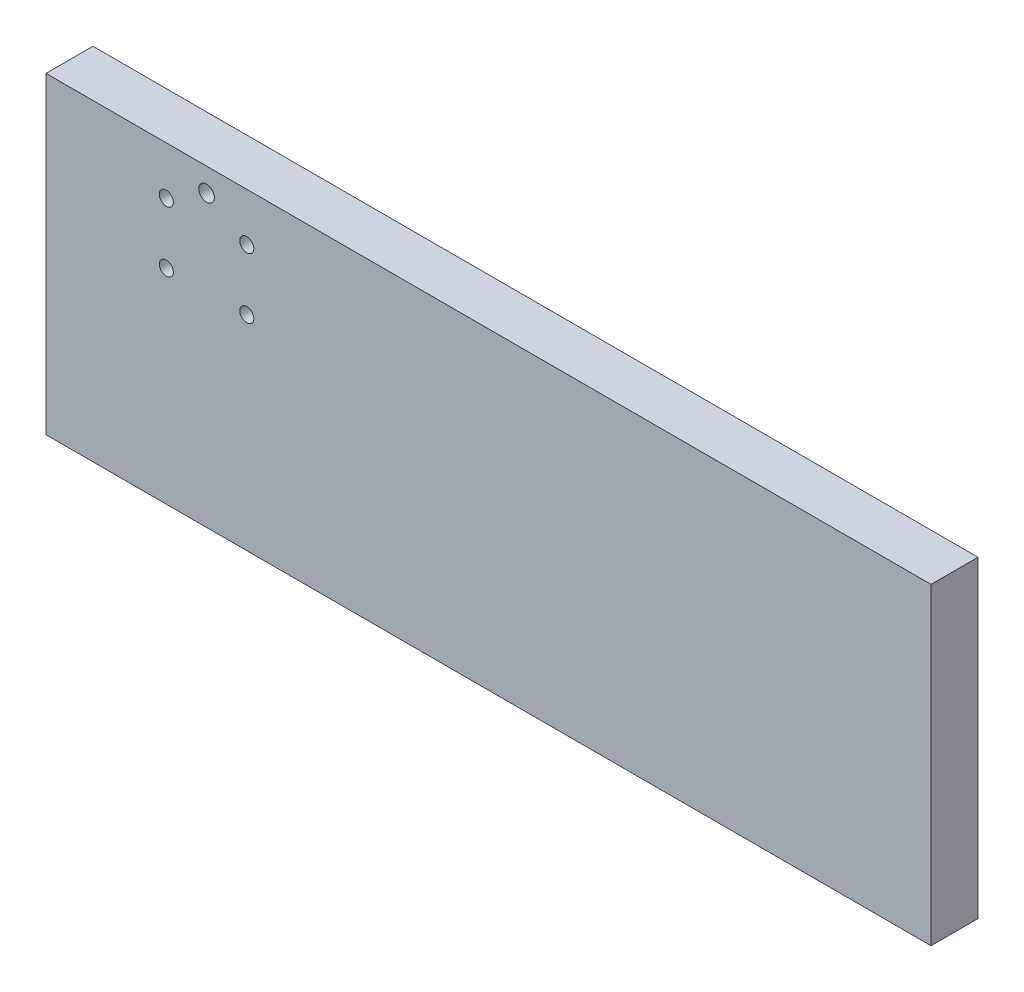
ISO-10303-21;
HEADER;
FILE_DESCRIPTION(('STEP AP214'),'2;1');
FILE_NAME('part.step','',(''),(''),'','','');
FILE_SCHEMA(('AUTOMOTIVE_DESIGN { 1 0 10303 214 1 1 1 1 }'));
ENDSEC;
DATA;
#1=APPLICATION_CONTEXT('core data for automotive mechanical design processes');
#2=APPLICATION_PROTOCOL_DEFINITION('international standard','automotive_design',2000,#1);
#3=PRODUCT_CONTEXT('',#1,'mechanical');
#4=PRODUCT('Part','Part','',(#3));
#5=PRODUCT_RELATED_PRODUCT_CATEGORY('part','',(#4));
#6=PRODUCT_DEFINITION_FORMATION('','',#4);
#7=PRODUCT_DEFINITION_CONTEXT('part definition',#1,'design');
#8=PRODUCT_DEFINITION('design','',#6,#7);
#9=PRODUCT_DEFINITION_SHAPE('','',#8);
#10=(LENGTH_UNIT() NAMED_UNIT(*) SI_UNIT(.MILLI.,.METRE.));
#11=(NAMED_UNIT(*) PLANE_ANGLE_UNIT() SI_UNIT($,.RADIAN.));
#12=(NAMED_UNIT(*) SI_UNIT($,.STERADIAN.) SOLID_ANGLE_UNIT());
#13=UNCERTAINTY_MEASURE_WITH_UNIT(LENGTH_MEASURE(1.E-05),#10,'distance_accuracy_value','');
#14=(GEOMETRIC_REPRESENTATION_CONTEXT(3) GLOBAL_UNCERTAINTY_ASSIGNED_CONTEXT((#13)) GLOBAL_UNIT_ASSIGNED_CONTEXT((#10,
#11,#12)) REPRESENTATION_CONTEXT('',''));
#15=CARTESIAN_POINT('',(0.,0.,0.));
#16=DIRECTION('',(0.,0.,1.));
#17=DIRECTION('',(1.,0.,0.));
#18=AXIS2_PLACEMENT_3D('',#15,#16,#17);
#19=CARTESIAN_POINT('',(0.,0.,19.05));
#20=DIRECTION('',(1.,0.,0.));
#21=DIRECTION('',(0.,0.,-1.));
#22=AXIS2_PLACEMENT_3D('',#19,#20,#21);
#23=PLANE('',#22);
#24=DIRECTION('',(0.,-1.,0.));
#25=VECTOR('',#24,1.);
#26=CARTESIAN_POINT('',(0.,0.,0.));
#27=LINE('',#26,#25);
#28=CARTESIAN_POINT('',(0.,127.,0.));
#29=VERTEX_POINT('',#28);
#30=CARTESIAN_POINT('',(0.,0.,0.));
#31=VERTEX_POINT('',#30);
#32=EDGE_CURVE('E96',#29,#31,#27,.T.);
#33=ORIENTED_EDGE('',*,*,#32,.T.);
#34=DIRECTION('',(0.,0.,-1.));
#35=VECTOR('',#34,1.);
#36=CARTESIAN_POINT('',(0.,0.,19.05));
#37=LINE('',#36,#35);
#38=CARTESIAN_POINT('',(0.,0.,19.05));
#39=VERTEX_POINT('',#38);
#40=EDGE_CURVE('E11',#39,#31,#37,.T.);
#41=ORIENTED_EDGE('',*,*,#40,.F.);
#42=DIRECTION('',(0.,-1.,0.));
#43=VECTOR('',#42,1.);
#44=CARTESIAN_POINT('',(0.,0.,19.05));
#45=LINE('',#44,#43);
#46=CARTESIAN_POINT('',(0.,127.,19.05));
#47=VERTEX_POINT('',#46);
#48=EDGE_CURVE('E84',#47,#39,#45,.T.);
#49=ORIENTED_EDGE('',*,*,#48,.F.);
#50=DIRECTION('',(0.,0.,-1.));
#51=VECTOR('',#50,1.);
#52=CARTESIAN_POINT('',(0.,127.,19.05));
#53=LINE('',#52,#51);
#54=EDGE_CURVE('E92',#47,#29,#53,.T.);
#55=ORIENTED_EDGE('',*,*,#54,.T.);
#56=EDGE_LOOP('',(#33,#41,#49,#55));
#57=FACE_BOUND('',#56,.T.);
#58=ADVANCED_FACE('F33',(#57),#23,.F.);
#59=CARTESIAN_POINT('',(0.,0.,19.05));
#60=DIRECTION('',(0.,1.,0.));
#61=DIRECTION('',(0.,0.,1.));
#62=AXIS2_PLACEMENT_3D('',#59,#60,#61);
#63=PLANE('',#62);
#64=DIRECTION('',(1.,0.,0.));
#65=VECTOR('',#64,1.);
#66=CARTESIAN_POINT('',(0.,0.,0.));
#67=LINE('',#66,#65);
#68=CARTESIAN_POINT('',(359.156,0.,0.));
#69=VERTEX_POINT('',#68);
#70=EDGE_CURVE('E88',#31,#69,#67,.T.);
#71=ORIENTED_EDGE('',*,*,#70,.T.);
#72=DIRECTION('',(0.,0.,-1.));
#73=VECTOR('',#72,1.);
#74=CARTESIAN_POINT('',(359.156,0.,19.05));
#75=LINE('',#74,#73);
#76=CARTESIAN_POINT('',(359.156,0.,19.05));
#77=VERTEX_POINT('',#76);
#78=EDGE_CURVE('E41',#77,#69,#75,.T.);
#79=ORIENTED_EDGE('',*,*,#78,.F.);
#80=DIRECTION('',(1.,0.,0.));
#81=VECTOR('',#80,1.);
#82=CARTESIAN_POINT('',(0.,0.,19.05));
#83=LINE('',#82,#81);
#84=EDGE_CURVE('E79',#39,#77,#83,.T.);
#85=ORIENTED_EDGE('',*,*,#84,.F.);
#86=ORIENTED_EDGE('',*,*,#40,.T.);
#87=EDGE_LOOP('',(#71,#79,#85,#86));
#88=FACE_BOUND('',#87,.T.);
#89=ADVANCED_FACE('F87',(#88),#63,.F.);
#90=CARTESIAN_POINT('',(359.156,0.,19.05));
#91=DIRECTION('',(-1.,0.,0.));
#92=DIRECTION('',(0.,0.,1.));
#93=AXIS2_PLACEMENT_3D('',#90,#91,#92);
#94=PLANE('',#93);
#95=DIRECTION('',(0.,1.,0.));
#96=VECTOR('',#95,1.);
#97=CARTESIAN_POINT('',(359.156,0.,0.));
#98=LINE('',#97,#96);
#99=CARTESIAN_POINT('',(359.156,127.,0.));
#100=VERTEX_POINT('',#99);
#101=EDGE_CURVE('E66',#69,#100,#98,.T.);
#102=ORIENTED_EDGE('',*,*,#101,.T.);
#103=DIRECTION('',(0.,0.,-1.));
#104=VECTOR('',#103,1.);
#105=CARTESIAN_POINT('',(359.156,127.,19.05));
#106=LINE('',#105,#104);
#107=CARTESIAN_POINT('',(359.156,127.,19.05));
#108=VERTEX_POINT('',#107);
#109=EDGE_CURVE('E89',#108,#100,#106,.T.);
#110=ORIENTED_EDGE('',*,*,#109,.F.);
#111=DIRECTION('',(0.,1.,0.));
#112=VECTOR('',#111,1.);
#113=CARTESIAN_POINT('',(359.156,0.,19.05));
#114=LINE('',#113,#112);
#115=EDGE_CURVE('E82',#77,#108,#114,.T.);
#116=ORIENTED_EDGE('',*,*,#115,.F.);
#117=ORIENTED_EDGE('',*,*,#78,.T.);
#118=EDGE_LOOP('',(#102,#110,#116,#117));
#119=FACE_BOUND('',#118,.T.);
#120=ADVANCED_FACE('F90',(#119),#94,.F.);
#121=CARTESIAN_POINT('',(0.,127.,19.05));
#122=DIRECTION('',(0.,-1.,0.));
#123=DIRECTION('',(0.,0.,-1.));
#124=AXIS2_PLACEMENT_3D('',#121,#122,#123);
#125=PLANE('',#124);
#126=DIRECTION('',(-1.,0.,0.));
#127=VECTOR('',#126,1.);
#128=CARTESIAN_POINT('',(0.,127.,0.));
#129=LINE('',#128,#127);
#130=EDGE_CURVE('E72',#100,#29,#129,.T.);
#131=ORIENTED_EDGE('',*,*,#130,.T.);
#132=ORIENTED_EDGE('',*,*,#54,.F.);
#133=DIRECTION('',(-1.,0.,0.));
#134=VECTOR('',#133,1.);
#135=CARTESIAN_POINT('',(0.,127.,19.05));
#136=LINE('',#135,#134);
#137=EDGE_CURVE('E49',#108,#47,#136,.T.);
#138=ORIENTED_EDGE('',*,*,#137,.F.);
#139=ORIENTED_EDGE('',*,*,#109,.T.);
#140=EDGE_LOOP('',(#131,#132,#138,#139));
#141=FACE_BOUND('',#140,.T.);
#142=ADVANCED_FACE('F104',(#141),#125,.F.);
#143=CARTESIAN_POINT('',(0.,0.,19.05));
#144=DIRECTION('',(0.,0.,-1.));
#145=DIRECTION('',(-1.,0.,0.));
#146=AXIS2_PLACEMENT_3D('',#143,#144,#145);
#147=PLANE('',#146);
#148=CARTESIAN_POINT('',(65.1510000000813,117.475000000113,19.05));
#149=DIRECTION('',(0.,0.,-1.));
#150=DIRECTION('',(-1.,0.,0.));
#151=AXIS2_PLACEMENT_3D('',#148,#149,#150);
#152=CIRCLE('',#151,3.175);
#153=CARTESIAN_POINT('',(61.9760000000813,117.475000000113,19.05));
#154=VERTEX_POINT('',#153);
#155=EDGE_CURVE('E120',#154,#154,#152,.F.);
#156=ORIENTED_EDGE('',*,*,#155,.F.);
#157=EDGE_LOOP('',(#156));
#158=FACE_BOUND('',#157,.T.);
#159=CARTESIAN_POINT('',(81.47685,82.9627499999999,19.05));
#160=DIRECTION('',(0.,0.,1.));
#161=DIRECTION('',(1.,0.,0.));
#162=AXIS2_PLACEMENT_3D('',#159,#160,#161);
#163=CIRCLE('',#162,2.85115);
#164=CARTESIAN_POINT('',(84.328,82.9627499999999,19.05));
#165=VERTEX_POINT('',#164);
#166=EDGE_CURVE('E119',#165,#165,#163,.T.);
#167=ORIENTED_EDGE('',*,*,#166,.F.);
#168=EDGE_LOOP('',(#167));
#169=FACE_BOUND('',#168,.T.);
#170=CARTESIAN_POINT('',(81.47685,107.53725,19.05));
#171=DIRECTION('',(0.,0.,1.));
#172=DIRECTION('',(1.,0.,0.));
#173=AXIS2_PLACEMENT_3D('',#170,#171,#172);
#174=CIRCLE('',#173,2.85115);
#175=CARTESIAN_POINT('',(84.328,107.53725,19.05));
#176=VERTEX_POINT('',#175);
#177=EDGE_CURVE('E126',#176,#176,#174,.T.);
#178=ORIENTED_EDGE('',*,*,#177,.F.);
#179=EDGE_LOOP('',(#178));
#180=FACE_BOUND('',#179,.T.);
#181=CARTESIAN_POINT('',(48.82515,107.53725,19.05));
#182=DIRECTION('',(0.,0.,1.));
#183=DIRECTION('',(1.,0.,0.));
#184=AXIS2_PLACEMENT_3D('',#181,#182,#183);
#185=CIRCLE('',#184,2.85115);
#186=CARTESIAN_POINT('',(51.6763,107.53725,19.05));
#187=VERTEX_POINT('',#186);
#188=EDGE_CURVE('E113',#187,#187,#185,.T.);
#189=ORIENTED_EDGE('',*,*,#188,.F.);
#190=EDGE_LOOP('',(#189));
#191=FACE_BOUND('',#190,.T.);
#192=CARTESIAN_POINT('',(48.82515,82.96275,19.05));
#193=DIRECTION('',(0.,0.,1.));
#194=DIRECTION('',(1.,0.,0.));
#195=AXIS2_PLACEMENT_3D('',#192,#193,#194);
#196=CIRCLE('',#195,2.85115);
#197=CARTESIAN_POINT('',(51.6763,82.96275,19.05));
#198=VERTEX_POINT('',#197);
#199=EDGE_CURVE('E99',#198,#198,#196,.T.);
#200=ORIENTED_EDGE('',*,*,#199,.F.);
#201=EDGE_LOOP('',(#200));
#202=FACE_BOUND('',#201,.T.);
#203=ORIENTED_EDGE('',*,*,#48,.T.);
#204=ORIENTED_EDGE('',*,*,#84,.T.);
#205=ORIENTED_EDGE('',*,*,#115,.T.);
#206=ORIENTED_EDGE('',*,*,#137,.T.);
#207=EDGE_LOOP('',(#203,#204,#205,#206));
#208=FACE_BOUND('',#207,.T.);
#209=ADVANCED_FACE('F80',(#158,#169,#180,#191,#202,#208),#147,.F.);
#210=CARTESIAN_POINT('',(0.,0.,0.));
#211=DIRECTION('',(0.,0.,-1.));
#212=DIRECTION('',(-1.,0.,0.));
#213=AXIS2_PLACEMENT_3D('',#210,#211,#212);
#214=PLANE('',#213);
#215=CARTESIAN_POINT('',(65.1510000000813,117.475000000113,0.));
#216=DIRECTION('',(0.,0.,-1.));
#217=DIRECTION('',(-1.,0.,0.));
#218=AXIS2_PLACEMENT_3D('',#215,#216,#217);
#219=CIRCLE('',#218,3.175);
#220=CARTESIAN_POINT('',(61.9760000000813,117.475000000113,0.));
#221=VERTEX_POINT('',#220);
#222=EDGE_CURVE('E136',#221,#221,#219,.T.);
#223=ORIENTED_EDGE('',*,*,#222,.F.);
#224=EDGE_LOOP('',(#223));
#225=FACE_BOUND('',#224,.T.);
#226=CARTESIAN_POINT('',(81.47685,82.9627499999999,0.));
#227=DIRECTION('',(0.,0.,-1.));
#228=DIRECTION('',(-1.,0.,0.));
#229=AXIS2_PLACEMENT_3D('',#226,#227,#228);
#230=CIRCLE('',#229,2.85115);
#231=CARTESIAN_POINT('',(78.6257,82.9627499999999,0.));
#232=VERTEX_POINT('',#231);
#233=EDGE_CURVE('E116',#232,#232,#230,.F.);
#234=ORIENTED_EDGE('',*,*,#233,.T.);
#235=EDGE_LOOP('',(#234));
#236=FACE_BOUND('',#235,.T.);
#237=CARTESIAN_POINT('',(81.47685,107.53725,0.));
#238=DIRECTION('',(0.,0.,-1.));
#239=DIRECTION('',(-1.,0.,0.));
#240=AXIS2_PLACEMENT_3D('',#237,#238,#239);
#241=CIRCLE('',#240,2.85115);
#242=CARTESIAN_POINT('',(78.6257,107.53725,0.));
#243=VERTEX_POINT('',#242);
#244=EDGE_CURVE('E123',#243,#243,#241,.F.);
#245=ORIENTED_EDGE('',*,*,#244,.T.);
#246=EDGE_LOOP('',(#245));
#247=FACE_BOUND('',#246,.T.);
#248=CARTESIAN_POINT('',(48.82515,107.53725,0.));
#249=DIRECTION('',(0.,0.,-1.));
#250=DIRECTION('',(-1.,0.,0.));
#251=AXIS2_PLACEMENT_3D('',#248,#249,#250);
#252=CIRCLE('',#251,2.85115);
#253=CARTESIAN_POINT('',(45.974,107.53725,0.));
#254=VERTEX_POINT('',#253);
#255=EDGE_CURVE('E129',#254,#254,#252,.F.);
#256=ORIENTED_EDGE('',*,*,#255,.T.);
#257=EDGE_LOOP('',(#256));
#258=FACE_BOUND('',#257,.T.);
#259=CARTESIAN_POINT('',(48.82515,82.96275,0.));
#260=DIRECTION('',(0.,0.,-1.));
#261=DIRECTION('',(-1.,0.,0.));
#262=AXIS2_PLACEMENT_3D('',#259,#260,#261);
#263=CIRCLE('',#262,2.85115);
#264=CARTESIAN_POINT('',(45.974,82.96275,0.));
#265=VERTEX_POINT('',#264);
#266=EDGE_CURVE('E110',#265,#265,#263,.F.);
#267=ORIENTED_EDGE('',*,*,#266,.T.);
#268=EDGE_LOOP('',(#267));
#269=FACE_BOUND('',#268,.T.);
#270=ORIENTED_EDGE('',*,*,#32,.F.);
#271=ORIENTED_EDGE('',*,*,#130,.F.);
#272=ORIENTED_EDGE('',*,*,#101,.F.);
#273=ORIENTED_EDGE('',*,*,#70,.F.);
#274=EDGE_LOOP('',(#270,#271,#272,#273));
#275=FACE_BOUND('',#274,.T.);
#276=ADVANCED_FACE('F107',(#225,#236,#247,#258,#269,#275),#214,.T.);
#277=CARTESIAN_POINT('',(48.82515,82.96275,-0.001000000000001));
#278=DIRECTION('',(0.,0.,1.));
#279=DIRECTION('',(1.,0.,0.));
#280=AXIS2_PLACEMENT_3D('',#277,#278,#279);
#281=CYLINDRICAL_SURFACE('',#280,2.85115);
#282=ORIENTED_EDGE('',*,*,#266,.F.);
#283=EDGE_LOOP('',(#282));
#284=FACE_BOUND('',#283,.T.);
#285=ORIENTED_EDGE('',*,*,#199,.T.);
#286=EDGE_LOOP('',(#285));
#287=FACE_BOUND('',#286,.T.);
#288=ADVANCED_FACE('F145',(#284,#287),#281,.F.);
#289=CARTESIAN_POINT('',(48.82515,107.53725,-0.001000000000001));
#290=DIRECTION('',(0.,0.,1.));
#291=DIRECTION('',(1.,0.,0.));
#292=AXIS2_PLACEMENT_3D('',#289,#290,#291);
#293=CYLINDRICAL_SURFACE('',#292,2.85115);
#294=ORIENTED_EDGE('',*,*,#255,.F.);
#295=EDGE_LOOP('',(#294));
#296=FACE_BOUND('',#295,.T.);
#297=ORIENTED_EDGE('',*,*,#188,.T.);
#298=EDGE_LOOP('',(#297));
#299=FACE_BOUND('',#298,.T.);
#300=ADVANCED_FACE('F157',(#296,#299),#293,.F.);
#301=CARTESIAN_POINT('',(81.47685,107.53725,-0.001000000000001));
#302=DIRECTION('',(0.,0.,1.));
#303=DIRECTION('',(1.,0.,0.));
#304=AXIS2_PLACEMENT_3D('',#301,#302,#303);
#305=CYLINDRICAL_SURFACE('',#304,2.85115);
#306=ORIENTED_EDGE('',*,*,#244,.F.);
#307=EDGE_LOOP('',(#306));
#308=FACE_BOUND('',#307,.T.);
#309=ORIENTED_EDGE('',*,*,#177,.T.);
#310=EDGE_LOOP('',(#309));
#311=FACE_BOUND('',#310,.T.);
#312=ADVANCED_FACE('F201',(#308,#311),#305,.F.);
#313=CARTESIAN_POINT('',(81.47685,82.9627499999999,-0.001000000000001));
#314=DIRECTION('',(0.,0.,1.));
#315=DIRECTION('',(1.,0.,0.));
#316=AXIS2_PLACEMENT_3D('',#313,#314,#315);
#317=CYLINDRICAL_SURFACE('',#316,2.85115);
#318=ORIENTED_EDGE('',*,*,#233,.F.);
#319=EDGE_LOOP('',(#318));
#320=FACE_BOUND('',#319,.T.);
#321=ORIENTED_EDGE('',*,*,#166,.T.);
#322=EDGE_LOOP('',(#321));
#323=FACE_BOUND('',#322,.T.);
#324=ADVANCED_FACE('F211',(#320,#323),#317,.F.);
#325=CARTESIAN_POINT('',(65.1510000000813,117.475000000113,19.051));
#326=DIRECTION('',(0.,0.,-1.));
#327=DIRECTION('',(-1.,0.,0.));
#328=AXIS2_PLACEMENT_3D('',#325,#326,#327);
#329=CYLINDRICAL_SURFACE('',#328,3.175);
#330=ORIENTED_EDGE('',*,*,#222,.T.);
#331=EDGE_LOOP('',(#330));
#332=FACE_BOUND('',#331,.T.);
#333=ORIENTED_EDGE('',*,*,#155,.T.);
#334=EDGE_LOOP('',(#333));
#335=FACE_BOUND('',#334,.T.);
#336=ADVANCED_FACE('F140',(#332,#335),#329,.F.);
#337=CLOSED_SHELL('',(#58,#89,#120,#142,#209,#276,#288,#300,#312,#324,#336));
#338=MANIFOLD_SOLID_BREP('B2',#337);
#339=ADVANCED_BREP_SHAPE_REPRESENTATION('',(#18,#338),#14);
#340=SHAPE_DEFINITION_REPRESENTATION(#9,#339);
ENDSEC;
END-ISO-10303-21;
